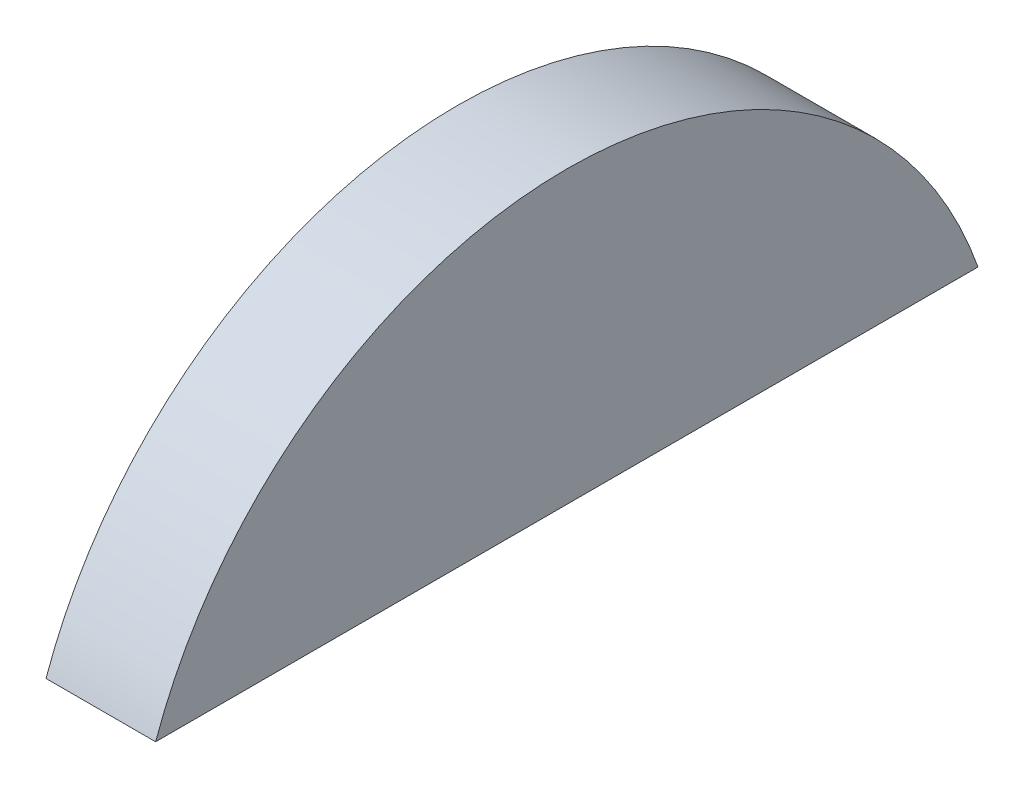
ISO-10303-21;
HEADER;
FILE_DESCRIPTION(('STEP AP214'),'2;1');
FILE_NAME('part.step','',(''),(''),'','','');
FILE_SCHEMA(('AUTOMOTIVE_DESIGN { 1 0 10303 214 1 1 1 1 }'));
ENDSEC;
DATA;
#1=APPLICATION_CONTEXT('core data for automotive mechanical design processes');
#2=APPLICATION_PROTOCOL_DEFINITION('international standard','automotive_design',2000,#1);
#3=PRODUCT_CONTEXT('',#1,'mechanical');
#4=PRODUCT('Part','Part','',(#3));
#5=PRODUCT_RELATED_PRODUCT_CATEGORY('part','',(#4));
#6=PRODUCT_DEFINITION_FORMATION('','',#4);
#7=PRODUCT_DEFINITION_CONTEXT('part definition',#1,'design');
#8=PRODUCT_DEFINITION('design','',#6,#7);
#9=PRODUCT_DEFINITION_SHAPE('','',#8);
#10=(LENGTH_UNIT() NAMED_UNIT(*) SI_UNIT(.MILLI.,.METRE.));
#11=(NAMED_UNIT(*) PLANE_ANGLE_UNIT() SI_UNIT($,.RADIAN.));
#12=(NAMED_UNIT(*) SI_UNIT($,.STERADIAN.) SOLID_ANGLE_UNIT());
#13=UNCERTAINTY_MEASURE_WITH_UNIT(LENGTH_MEASURE(1.E-05),#10,'distance_accuracy_value','');
#14=(GEOMETRIC_REPRESENTATION_CONTEXT(3) GLOBAL_UNCERTAINTY_ASSIGNED_CONTEXT((#13)) GLOBAL_UNIT_ASSIGNED_CONTEXT((#10,
#11,#12)) REPRESENTATION_CONTEXT('',''));
#15=CARTESIAN_POINT('',(0.,0.,0.));
#16=DIRECTION('',(0.,0.,1.));
#17=DIRECTION('',(1.,0.,0.));
#18=AXIS2_PLACEMENT_3D('',#15,#16,#17);
#19=CARTESIAN_POINT('',(5.08,0.,0.));
#20=DIRECTION('',(-1.,0.,0.));
#21=DIRECTION('',(0.,0.,1.));
#22=AXIS2_PLACEMENT_3D('',#19,#20,#21);
#23=CYLINDRICAL_SURFACE('',#22,20.2097735849057);
#24=CARTESIAN_POINT('',(0.,0.,0.));
#25=DIRECTION('',(1.,0.,0.));
#26=DIRECTION('',(0.,0.,-1.));
#27=AXIS2_PLACEMENT_3D('',#24,#25,#26);
#28=CIRCLE('',#27,20.2097735849057);
#29=CARTESIAN_POINT('',(0.,6.74777358490566,-19.05));
#30=VERTEX_POINT('',#29);
#31=CARTESIAN_POINT('',(0.,6.74777358490566,19.05));
#32=VERTEX_POINT('',#31);
#33=EDGE_CURVE('E59',#30,#32,#28,.T.);
#34=ORIENTED_EDGE('',*,*,#33,.T.);
#35=DIRECTION('',(-1.,0.,0.));
#36=VECTOR('',#35,1.);
#37=CARTESIAN_POINT('',(5.07999999999999,6.74777358490568,19.05));
#38=LINE('',#37,#36);
#39=CARTESIAN_POINT('',(5.07999999999999,6.74777358490568,19.05));
#40=VERTEX_POINT('',#39);
#41=EDGE_CURVE('E11',#40,#32,#38,.T.);
#42=ORIENTED_EDGE('',*,*,#41,.F.);
#43=CARTESIAN_POINT('',(5.08,0.,0.));
#44=DIRECTION('',(1.,0.,0.));
#45=DIRECTION('',(0.,0.,-1.));
#46=AXIS2_PLACEMENT_3D('',#43,#44,#45);
#47=CIRCLE('',#46,20.2097735849057);
#48=CARTESIAN_POINT('',(5.07999999999999,6.74777358490568,-19.05));
#49=VERTEX_POINT('',#48);
#50=EDGE_CURVE('E58',#49,#40,#47,.T.);
#51=ORIENTED_EDGE('',*,*,#50,.F.);
#52=DIRECTION('',(-1.,0.,0.));
#53=VECTOR('',#52,1.);
#54=CARTESIAN_POINT('',(5.07999999999999,6.74777358490568,-19.05));
#55=LINE('',#54,#53);
#56=EDGE_CURVE('E36',#49,#30,#55,.T.);
#57=ORIENTED_EDGE('',*,*,#56,.T.);
#58=EDGE_LOOP('',(#34,#42,#51,#57));
#59=FACE_BOUND('',#58,.T.);
#60=ADVANCED_FACE('F28',(#59),#23,.T.);
#61=CARTESIAN_POINT('',(5.07999999999999,6.74777358490568,19.05));
#62=DIRECTION('',(0.,1.,0.));
#63=DIRECTION('',(0.,0.,1.));
#64=AXIS2_PLACEMENT_3D('',#61,#62,#63);
#65=PLANE('',#64);
#66=DIRECTION('',(0.,0.,-1.));
#67=VECTOR('',#66,1.);
#68=CARTESIAN_POINT('',(0.,6.74777358490566,19.05));
#69=LINE('',#68,#67);
#70=EDGE_CURVE('E51',#32,#30,#69,.T.);
#71=ORIENTED_EDGE('',*,*,#70,.T.);
#72=ORIENTED_EDGE('',*,*,#56,.F.);
#73=DIRECTION('',(0.,0.,-1.));
#74=VECTOR('',#73,1.);
#75=CARTESIAN_POINT('',(5.07999999999999,6.74777358490568,19.05));
#76=LINE('',#75,#74);
#77=EDGE_CURVE('E43',#40,#49,#76,.T.);
#78=ORIENTED_EDGE('',*,*,#77,.F.);
#79=ORIENTED_EDGE('',*,*,#41,.T.);
#80=EDGE_LOOP('',(#71,#72,#78,#79));
#81=FACE_BOUND('',#80,.T.);
#82=ADVANCED_FACE('F54',(#81),#65,.F.);
#83=CARTESIAN_POINT('',(5.08,0.,0.));
#84=DIRECTION('',(1.,0.,0.));
#85=DIRECTION('',(0.,0.,-1.));
#86=AXIS2_PLACEMENT_3D('',#83,#84,#85);
#87=PLANE('',#86);
#88=ORIENTED_EDGE('',*,*,#50,.T.);
#89=ORIENTED_EDGE('',*,*,#77,.T.);
#90=EDGE_LOOP('',(#88,#89));
#91=FACE_BOUND('',#90,.T.);
#92=ADVANCED_FACE('F66',(#91),#87,.T.);
#93=CARTESIAN_POINT('',(0.,0.,0.));
#94=DIRECTION('',(1.,0.,0.));
#95=DIRECTION('',(0.,0.,-1.));
#96=AXIS2_PLACEMENT_3D('',#93,#94,#95);
#97=PLANE('',#96);
#98=ORIENTED_EDGE('',*,*,#33,.F.);
#99=ORIENTED_EDGE('',*,*,#70,.F.);
#100=EDGE_LOOP('',(#98,#99));
#101=FACE_BOUND('',#100,.T.);
#102=ADVANCED_FACE('F62',(#101),#97,.F.);
#103=CLOSED_SHELL('',(#60,#82,#92,#102));
#104=MANIFOLD_SOLID_BREP('B2',#103);
#105=ADVANCED_BREP_SHAPE_REPRESENTATION('',(#18,#104),#14);
#106=SHAPE_DEFINITION_REPRESENTATION(#9,#105);
ENDSEC;
END-ISO-10303-21;
